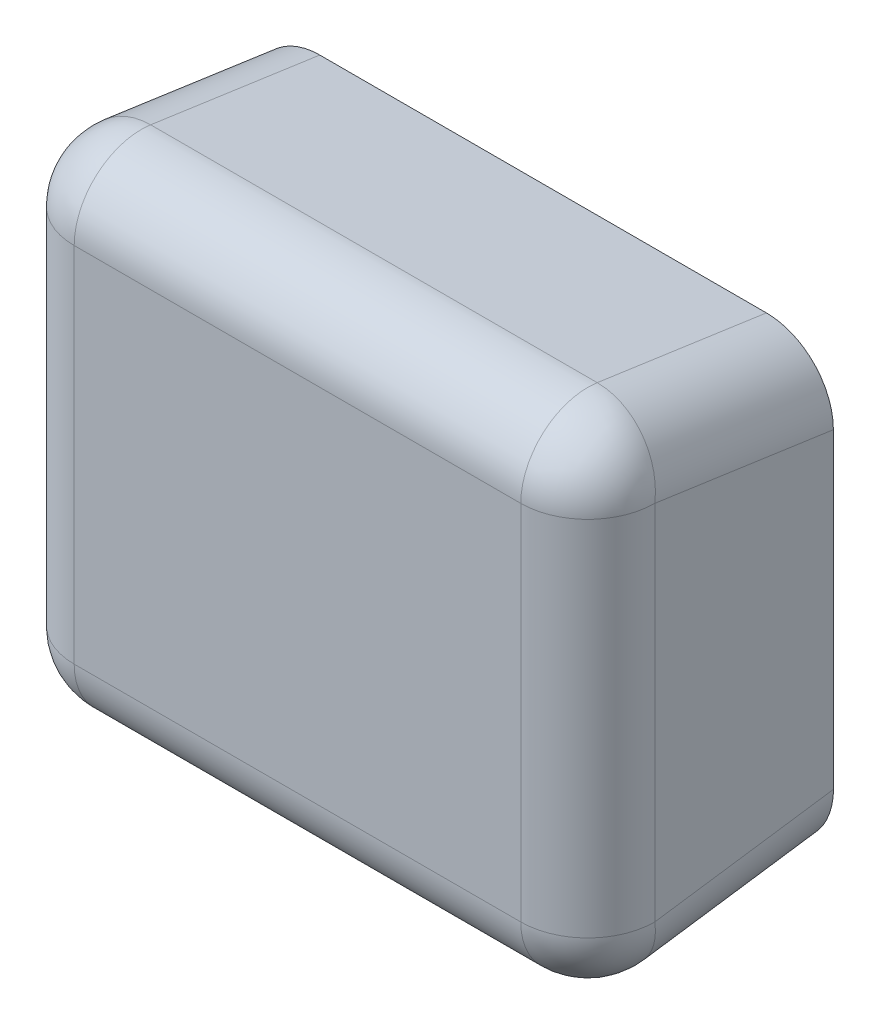
ISO-10303-21;
HEADER;
FILE_DESCRIPTION(('STEP AP214'),'2;1');
FILE_NAME('part.step','',(''),(''),'','','');
FILE_SCHEMA(('AUTOMOTIVE_DESIGN { 1 0 10303 214 1 1 1 1 }'));
ENDSEC;
DATA;
#1=APPLICATION_CONTEXT('core data for automotive mechanical design processes');
#2=APPLICATION_PROTOCOL_DEFINITION('international standard','automotive_design',2000,#1);
#3=PRODUCT_CONTEXT('',#1,'mechanical');
#4=PRODUCT('Part','Part','',(#3));
#5=PRODUCT_RELATED_PRODUCT_CATEGORY('part','',(#4));
#6=PRODUCT_DEFINITION_FORMATION('','',#4);
#7=PRODUCT_DEFINITION_CONTEXT('part definition',#1,'design');
#8=PRODUCT_DEFINITION('design','',#6,#7);
#9=PRODUCT_DEFINITION_SHAPE('','',#8);
#10=(LENGTH_UNIT() NAMED_UNIT(*) SI_UNIT(.MILLI.,.METRE.));
#11=(NAMED_UNIT(*) PLANE_ANGLE_UNIT() SI_UNIT($,.RADIAN.));
#12=(NAMED_UNIT(*) SI_UNIT($,.STERADIAN.) SOLID_ANGLE_UNIT());
#13=UNCERTAINTY_MEASURE_WITH_UNIT(LENGTH_MEASURE(1.E-05),#10,'distance_accuracy_value','');
#14=(GEOMETRIC_REPRESENTATION_CONTEXT(3) GLOBAL_UNCERTAINTY_ASSIGNED_CONTEXT((#13)) GLOBAL_UNIT_ASSIGNED_CONTEXT((#10,
#11,#12)) REPRESENTATION_CONTEXT('',''));
#15=CARTESIAN_POINT('',(0.,0.,0.));
#16=DIRECTION('',(0.,0.,1.));
#17=DIRECTION('',(1.,0.,0.));
#18=AXIS2_PLACEMENT_3D('',#15,#16,#17);
#19=CARTESIAN_POINT('',(0.,0.,0.));
#20=DIRECTION('',(0.,0.,1.));
#21=DIRECTION('',(1.,0.,0.));
#22=AXIS2_PLACEMENT_3D('',#19,#20,#21);
#23=PLANE('',#22);
#24=DIRECTION('',(-1.,0.,0.));
#25=VECTOR('',#24,1.);
#26=CARTESIAN_POINT('',(250.,200.101525445522,0.));
#27=LINE('',#26,#25);
#28=CARTESIAN_POINT('',(200.,200.101525445522,0.));
#29=VERTEX_POINT('',#28);
#30=CARTESIAN_POINT('',(-200.,200.101525445522,0.));
#31=VERTEX_POINT('',#30);
#32=EDGE_CURVE('E221',#29,#31,#27,.T.);
#33=ORIENTED_EDGE('',*,*,#32,.F.);
#34=CARTESIAN_POINT('',(200.,139.492372772389,0.));
#35=DIRECTION('',(0.,0.,1.));
#36=DIRECTION('',(0.,-1.,0.));
#37=AXIS2_PLACEMENT_3D('',#34,#35,#36);
#38=ELLIPSE('',#37,60.6091526731326,60.);
#39=CARTESIAN_POINT('',(260.,139.492372772389,0.));
#40=VERTEX_POINT('',#39);
#41=EDGE_CURVE('E127',#29,#40,#38,.F.);
#42=ORIENTED_EDGE('',*,*,#41,.T.);
#43=DIRECTION('',(0.,1.,0.));
#44=VECTOR('',#43,1.);
#45=CARTESIAN_POINT('',(260.,0.,0.));
#46=LINE('',#45,#44);
#47=CARTESIAN_POINT('',(260.,-139.49237277239,0.));
#48=VERTEX_POINT('',#47);
#49=EDGE_CURVE('E122',#48,#40,#46,.T.);
#50=ORIENTED_EDGE('',*,*,#49,.F.);
#51=CARTESIAN_POINT('',(200.,-139.492372772389,0.));
#52=DIRECTION('',(0.,0.,1.));
#53=DIRECTION('',(0.,-1.,0.));
#54=AXIS2_PLACEMENT_3D('',#51,#52,#53);
#55=ELLIPSE('',#54,60.6091526731327,60.);
#56=CARTESIAN_POINT('',(200.,-200.101525445522,0.));
#57=VERTEX_POINT('',#56);
#58=EDGE_CURVE('E124',#48,#57,#55,.F.);
#59=ORIENTED_EDGE('',*,*,#58,.T.);
#60=DIRECTION('',(1.,0.,0.));
#61=VECTOR('',#60,1.);
#62=CARTESIAN_POINT('',(250.,-200.101525445522,0.));
#63=LINE('',#62,#61);
#64=CARTESIAN_POINT('',(-200.,-200.101525445522,0.));
#65=VERTEX_POINT('',#64);
#66=EDGE_CURVE('E157',#65,#57,#63,.T.);
#67=ORIENTED_EDGE('',*,*,#66,.F.);
#68=CARTESIAN_POINT('',(-200.,-139.492372772389,0.));
#69=DIRECTION('',(0.,0.,1.));
#70=DIRECTION('',(0.,1.,0.));
#71=AXIS2_PLACEMENT_3D('',#68,#69,#70);
#72=ELLIPSE('',#71,60.6091526731327,60.);
#73=CARTESIAN_POINT('',(-260.,-139.492372772389,0.));
#74=VERTEX_POINT('',#73);
#75=EDGE_CURVE('E163',#65,#74,#72,.F.);
#76=ORIENTED_EDGE('',*,*,#75,.T.);
#77=DIRECTION('',(0.,1.,0.));
#78=VECTOR('',#77,1.);
#79=CARTESIAN_POINT('',(-260.,0.,0.));
#80=LINE('',#79,#78);
#81=CARTESIAN_POINT('',(-260.,139.492372772389,0.));
#82=VERTEX_POINT('',#81);
#83=EDGE_CURVE('E187',#74,#82,#80,.T.);
#84=ORIENTED_EDGE('',*,*,#83,.T.);
#85=CARTESIAN_POINT('',(-200.,139.492372772389,0.));
#86=DIRECTION('',(0.,0.,1.));
#87=DIRECTION('',(0.,1.,0.));
#88=AXIS2_PLACEMENT_3D('',#85,#86,#87);
#89=ELLIPSE('',#88,60.6091526731326,60.);
#90=EDGE_CURVE('E61',#82,#31,#89,.F.);
#91=ORIENTED_EDGE('',*,*,#90,.T.);
#92=EDGE_LOOP('',(#33,#42,#50,#59,#67,#76,#84,#91));
#93=FACE_BOUND('',#92,.T.);
#94=ADVANCED_FACE('F47',(#93),#23,.F.);
#95=CARTESIAN_POINT('',(200.,-136.702525316942,-19.5289321881345));
#96=DIRECTION('',(0.,-0.14142135623731,0.989949493661166));
#97=DIRECTION('',(0.,-0.989949493661167,-0.14142135623731));
#98=AXIS2_PLACEMENT_3D('',#95,#96,#97);
#99=CYLINDRICAL_SURFACE('',#98,60.);
#100=ORIENTED_EDGE('',*,*,#58,.F.);
#101=DIRECTION('',(0.,-0.14142135623731,0.989949493661166));
#102=VECTOR('',#101,1.);
#103=CARTESIAN_POINT('',(260.,-136.702525316942,-19.5289321881345));
#104=LINE('',#103,#102);
#105=CARTESIAN_POINT('',(260.,-162.349515629532,160.));
#106=VERTEX_POINT('',#105);
#107=EDGE_CURVE('E137',#106,#48,#104,.F.);
#108=ORIENTED_EDGE('',*,*,#107,.F.);
#109=CARTESIAN_POINT('',(200.,-162.349515629532,160.));
#110=DIRECTION('',(0.,-0.141421356237309,0.989949493661167));
#111=DIRECTION('',(0.,-0.989949493661167,-0.141421356237309));
#112=AXIS2_PLACEMENT_3D('',#109,#110,#111);
#113=CIRCLE('',#112,60.);
#114=CARTESIAN_POINT('',(200.,-221.746485249202,151.514718625761));
#115=VERTEX_POINT('',#114);
#116=EDGE_CURVE('E149',#115,#106,#113,.T.);
#117=ORIENTED_EDGE('',*,*,#116,.F.);
#118=DIRECTION('',(0.,-0.14142135623731,0.989949493661166));
#119=VECTOR('',#118,1.);
#120=CARTESIAN_POINT('',(200.,-229.899494936612,208.585786437627));
#121=LINE('',#120,#119);
#122=EDGE_CURVE('E140',#57,#115,#121,.T.);
#123=ORIENTED_EDGE('',*,*,#122,.F.);
#124=EDGE_LOOP('',(#100,#108,#117,#123));
#125=FACE_BOUND('',#124,.T.);
#126=ADVANCED_FACE('F136',(#125),#99,.T.);
#127=CARTESIAN_POINT('',(250.,-229.899494936612,208.585786437627));
#128=DIRECTION('',(0.,0.989949493661167,0.14142135623731));
#129=DIRECTION('',(0.,-0.14142135623731,0.989949493661166));
#130=AXIS2_PLACEMENT_3D('',#127,#128,#129);
#131=PLANE('',#130);
#132=DIRECTION('',(0.,-0.14142135623731,0.989949493661166));
#133=VECTOR('',#132,1.);
#134=CARTESIAN_POINT('',(-200.,-229.899494936612,208.585786437627));
#135=LINE('',#134,#133);
#136=CARTESIAN_POINT('',(-200.,-221.746485249202,151.514718625761));
#137=VERTEX_POINT('',#136);
#138=EDGE_CURVE('E154',#137,#65,#135,.F.);
#139=ORIENTED_EDGE('',*,*,#138,.T.);
#140=ORIENTED_EDGE('',*,*,#66,.T.);
#141=ORIENTED_EDGE('',*,*,#122,.T.);
#142=DIRECTION('',(1.,0.,0.));
#143=VECTOR('',#142,1.);
#144=CARTESIAN_POINT('',(250.,-221.746485249202,151.514718625761));
#145=LINE('',#144,#143);
#146=EDGE_CURVE('E160',#115,#137,#145,.F.);
#147=ORIENTED_EDGE('',*,*,#146,.T.);
#148=EDGE_LOOP('',(#139,#140,#141,#147));
#149=FACE_BOUND('',#148,.T.);
#150=ADVANCED_FACE('F297',(#149),#131,.F.);
#151=CARTESIAN_POINT('',(-200.,-170.502525316942,217.071067811865));
#152=DIRECTION('',(0.,0.14142135623731,-0.989949493661166));
#153=DIRECTION('',(0.,0.989949493661167,0.14142135623731));
#154=AXIS2_PLACEMENT_3D('',#151,#152,#153);
#155=CYLINDRICAL_SURFACE('',#154,60.);
#156=ORIENTED_EDGE('',*,*,#75,.F.);
#157=ORIENTED_EDGE('',*,*,#138,.F.);
#158=CARTESIAN_POINT('',(-200.,-162.349515629532,160.));
#159=DIRECTION('',(0.,0.14142135623731,-0.989949493661166));
#160=DIRECTION('',(0.,0.989949493661166,0.14142135623731));
#161=AXIS2_PLACEMENT_3D('',#158,#159,#160);
#162=CIRCLE('',#161,60.);
#163=CARTESIAN_POINT('',(-260.,-162.349515629532,160.));
#164=VERTEX_POINT('',#163);
#165=EDGE_CURVE('E166',#164,#137,#162,.F.);
#166=ORIENTED_EDGE('',*,*,#165,.F.);
#167=DIRECTION('',(0.,0.14142135623731,-0.989949493661166));
#168=VECTOR('',#167,1.);
#169=CARTESIAN_POINT('',(-260.,-170.502525316942,217.071067811865));
#170=LINE('',#169,#168);
#171=EDGE_CURVE('E133',#74,#164,#170,.F.);
#172=ORIENTED_EDGE('',*,*,#171,.F.);
#173=EDGE_LOOP('',(#156,#157,#166,#172));
#174=FACE_BOUND('',#173,.T.);
#175=ADVANCED_FACE('F294',(#174),#155,.T.);
#176=CARTESIAN_POINT('',(260.,0.,0.));
#177=DIRECTION('',(1.,0.,0.));
#178=DIRECTION('',(0.,0.,-1.));
#179=AXIS2_PLACEMENT_3D('',#176,#177,#178);
#180=PLANE('',#179);
#181=ORIENTED_EDGE('',*,*,#49,.T.);
#182=DIRECTION('',(0.,-0.141421356237309,-0.989949493661167));
#183=VECTOR('',#182,1.);
#184=CARTESIAN_POINT('',(260.,136.702525316942,-19.5289321881345));
#185=LINE('',#184,#183);
#186=CARTESIAN_POINT('',(260.,162.349515629532,160.));
#187=VERTEX_POINT('',#186);
#188=EDGE_CURVE('E132',#40,#187,#185,.F.);
#189=ORIENTED_EDGE('',*,*,#188,.T.);
#190=DIRECTION('',(0.,1.,0.));
#191=VECTOR('',#190,1.);
#192=CARTESIAN_POINT('',(260.,0.,160.));
#193=LINE('',#192,#191);
#194=EDGE_CURVE('E147',#187,#106,#193,.F.);
#195=ORIENTED_EDGE('',*,*,#194,.T.);
#196=ORIENTED_EDGE('',*,*,#107,.T.);
#197=EDGE_LOOP('',(#181,#189,#195,#196));
#198=FACE_BOUND('',#197,.T.);
#199=ADVANCED_FACE('F145',(#198),#180,.T.);
#200=CARTESIAN_POINT('',(200.,-162.349515629532,160.));
#201=DIRECTION('',(1.,0.,0.));
#202=DIRECTION('',(0.,0.,-1.));
#203=AXIS2_PLACEMENT_3D('',#200,#201,#202);
#204=SPHERICAL_SURFACE('',#203,60.);
#205=CARTESIAN_POINT('',(200.,-162.349515629532,160.));
#206=DIRECTION('',(1.,0.,0.));
#207=DIRECTION('',(0.,0.,-1.));
#208=AXIS2_PLACEMENT_3D('',#205,#206,#207);
#209=CIRCLE('',#208,60.);
#210=CARTESIAN_POINT('',(200.,-162.349515629532,220.));
#211=VERTEX_POINT('',#210);
#212=EDGE_CURVE('E173',#211,#115,#209,.T.);
#213=ORIENTED_EDGE('',*,*,#212,.T.);
#214=ORIENTED_EDGE('',*,*,#116,.T.);
#215=CARTESIAN_POINT('',(200.,-162.349515629532,160.));
#216=DIRECTION('',(0.,1.,0.));
#217=DIRECTION('',(0.,0.,1.));
#218=AXIS2_PLACEMENT_3D('',#215,#216,#217);
#219=CIRCLE('',#218,60.);
#220=EDGE_CURVE('E176',#211,#106,#219,.T.);
#221=ORIENTED_EDGE('',*,*,#220,.F.);
#222=EDGE_LOOP('',(#213,#214,#221));
#223=FACE_BOUND('',#222,.T.);
#224=ADVANCED_FACE('F287',(#223),#204,.T.);
#225=CARTESIAN_POINT('',(250.,-162.349515629532,160.));
#226=DIRECTION('',(-1.,0.,0.));
#227=DIRECTION('',(0.,0.,1.));
#228=AXIS2_PLACEMENT_3D('',#225,#226,#227);
#229=CYLINDRICAL_SURFACE('',#228,60.);
#230=CARTESIAN_POINT('',(-200.,-162.349515629532,160.));
#231=DIRECTION('',(-1.,0.,0.));
#232=DIRECTION('',(0.,0.,1.));
#233=AXIS2_PLACEMENT_3D('',#230,#231,#232);
#234=CIRCLE('',#233,60.);
#235=CARTESIAN_POINT('',(-200.,-162.349515629532,220.));
#236=VERTEX_POINT('',#235);
#237=EDGE_CURVE('E178',#236,#137,#234,.F.);
#238=ORIENTED_EDGE('',*,*,#237,.T.);
#239=ORIENTED_EDGE('',*,*,#146,.F.);
#240=ORIENTED_EDGE('',*,*,#212,.F.);
#241=DIRECTION('',(1.,0.,0.));
#242=VECTOR('',#241,1.);
#243=CARTESIAN_POINT('',(250.,-162.349515629532,220.));
#244=LINE('',#243,#242);
#245=EDGE_CURVE('E181',#236,#211,#244,.T.);
#246=ORIENTED_EDGE('',*,*,#245,.F.);
#247=EDGE_LOOP('',(#238,#239,#240,#246));
#248=FACE_BOUND('',#247,.T.);
#249=ADVANCED_FACE('F283',(#248),#229,.T.);
#250=CARTESIAN_POINT('',(-200.,-162.349515629532,160.));
#251=DIRECTION('',(-1.,0.,0.));
#252=DIRECTION('',(0.,0.,1.));
#253=AXIS2_PLACEMENT_3D('',#250,#251,#252);
#254=SPHERICAL_SURFACE('',#253,60.);
#255=CARTESIAN_POINT('',(-200.,-162.349515629532,160.));
#256=DIRECTION('',(0.,-1.,0.));
#257=DIRECTION('',(0.,0.,-1.));
#258=AXIS2_PLACEMENT_3D('',#255,#256,#257);
#259=CIRCLE('',#258,60.);
#260=EDGE_CURVE('E184',#236,#164,#259,.T.);
#261=ORIENTED_EDGE('',*,*,#260,.T.);
#262=ORIENTED_EDGE('',*,*,#165,.T.);
#263=ORIENTED_EDGE('',*,*,#237,.F.);
#264=EDGE_LOOP('',(#261,#262,#263));
#265=FACE_BOUND('',#264,.T.);
#266=ADVANCED_FACE('F279',(#265),#254,.T.);
#267=CARTESIAN_POINT('',(-260.,0.,0.));
#268=DIRECTION('',(1.,0.,0.));
#269=DIRECTION('',(0.,0.,-1.));
#270=AXIS2_PLACEMENT_3D('',#267,#268,#269);
#271=PLANE('',#270);
#272=ORIENTED_EDGE('',*,*,#83,.F.);
#273=ORIENTED_EDGE('',*,*,#171,.T.);
#274=DIRECTION('',(0.,1.,0.));
#275=VECTOR('',#274,1.);
#276=CARTESIAN_POINT('',(-260.,0.,160.));
#277=LINE('',#276,#275);
#278=CARTESIAN_POINT('',(-260.,162.349515629532,160.));
#279=VERTEX_POINT('',#278);
#280=EDGE_CURVE('E190',#164,#279,#277,.T.);
#281=ORIENTED_EDGE('',*,*,#280,.T.);
#282=DIRECTION('',(0.,0.141421356237309,0.989949493661167));
#283=VECTOR('',#282,1.);
#284=CARTESIAN_POINT('',(-260.,140.502525316942,7.07106781186552));
#285=LINE('',#284,#283);
#286=EDGE_CURVE('E192',#279,#82,#285,.F.);
#287=ORIENTED_EDGE('',*,*,#286,.T.);
#288=EDGE_LOOP('',(#272,#273,#281,#287));
#289=FACE_BOUND('',#288,.T.);
#290=ADVANCED_FACE('F275',(#289),#271,.F.);
#291=CARTESIAN_POINT('',(200.,136.702525316942,-19.5289321881345));
#292=DIRECTION('',(0.,-0.141421356237309,-0.989949493661167));
#293=DIRECTION('',(0.,0.989949493661167,-0.141421356237309));
#294=AXIS2_PLACEMENT_3D('',#291,#292,#293);
#295=CYLINDRICAL_SURFACE('',#294,60.);
#296=ORIENTED_EDGE('',*,*,#41,.F.);
#297=DIRECTION('',(0.,-0.141421356237309,-0.989949493661167));
#298=VECTOR('',#297,1.);
#299=CARTESIAN_POINT('',(200.,199.899494936612,-1.41421356237305));
#300=LINE('',#299,#298);
#301=CARTESIAN_POINT('',(200.,221.746485249202,151.514718625761));
#302=VERTEX_POINT('',#301);
#303=EDGE_CURVE('E197',#302,#29,#300,.T.);
#304=ORIENTED_EDGE('',*,*,#303,.F.);
#305=CARTESIAN_POINT('',(200.,162.349515629532,160.));
#306=DIRECTION('',(0.,-0.14142135623731,-0.989949493661166));
#307=DIRECTION('',(0.,0.989949493661167,-0.14142135623731));
#308=AXIS2_PLACEMENT_3D('',#305,#306,#307);
#309=CIRCLE('',#308,60.);
#310=EDGE_CURVE('E200',#187,#302,#309,.F.);
#311=ORIENTED_EDGE('',*,*,#310,.F.);
#312=ORIENTED_EDGE('',*,*,#188,.F.);
#313=EDGE_LOOP('',(#296,#304,#311,#312));
#314=FACE_BOUND('',#313,.T.);
#315=ADVANCED_FACE('F271',(#314),#295,.T.);
#316=CARTESIAN_POINT('',(200.,0.,160.));
#317=DIRECTION('',(0.,1.,0.));
#318=DIRECTION('',(0.,0.,1.));
#319=AXIS2_PLACEMENT_3D('',#316,#317,#318);
#320=CYLINDRICAL_SURFACE('',#319,60.);
#321=CARTESIAN_POINT('',(200.,162.349515629532,160.));
#322=DIRECTION('',(0.,1.,0.));
#323=DIRECTION('',(0.,0.,1.));
#324=AXIS2_PLACEMENT_3D('',#321,#322,#323);
#325=CIRCLE('',#324,60.);
#326=CARTESIAN_POINT('',(200.,162.349515629532,220.));
#327=VERTEX_POINT('',#326);
#328=EDGE_CURVE('E203',#187,#327,#325,.F.);
#329=ORIENTED_EDGE('',*,*,#328,.T.);
#330=DIRECTION('',(0.,1.,0.));
#331=VECTOR('',#330,1.);
#332=CARTESIAN_POINT('',(200.,220.,220.));
#333=LINE('',#332,#331);
#334=EDGE_CURVE('E205',#211,#327,#333,.T.);
#335=ORIENTED_EDGE('',*,*,#334,.F.);
#336=ORIENTED_EDGE('',*,*,#220,.T.);
#337=ORIENTED_EDGE('',*,*,#194,.F.);
#338=EDGE_LOOP('',(#329,#335,#336,#337));
#339=FACE_BOUND('',#338,.T.);
#340=ADVANCED_FACE('F268',(#339),#320,.T.);
#341=CARTESIAN_POINT('',(250.,220.,220.));
#342=DIRECTION('',(0.,0.,-1.));
#343=DIRECTION('',(0.,1.,0.));
#344=AXIS2_PLACEMENT_3D('',#341,#342,#343);
#345=PLANE('',#344);
#346=ORIENTED_EDGE('',*,*,#245,.T.);
#347=ORIENTED_EDGE('',*,*,#334,.T.);
#348=DIRECTION('',(1.,0.,0.));
#349=VECTOR('',#348,1.);
#350=CARTESIAN_POINT('',(250.,162.349515629532,220.));
#351=LINE('',#350,#349);
#352=CARTESIAN_POINT('',(-200.,162.349515629532,220.));
#353=VERTEX_POINT('',#352);
#354=EDGE_CURVE('E208',#327,#353,#351,.F.);
#355=ORIENTED_EDGE('',*,*,#354,.T.);
#356=DIRECTION('',(0.,1.,0.));
#357=VECTOR('',#356,1.);
#358=CARTESIAN_POINT('',(-200.,220.,220.));
#359=LINE('',#358,#357);
#360=EDGE_CURVE('E210',#353,#236,#359,.F.);
#361=ORIENTED_EDGE('',*,*,#360,.T.);
#362=EDGE_LOOP('',(#346,#347,#355,#361));
#363=FACE_BOUND('',#362,.T.);
#364=ADVANCED_FACE('F240',(#363),#345,.F.);
#365=CARTESIAN_POINT('',(-200.,220.,160.));
#366=DIRECTION('',(0.,-1.,0.));
#367=DIRECTION('',(0.,0.,-1.));
#368=AXIS2_PLACEMENT_3D('',#365,#366,#367);
#369=CYLINDRICAL_SURFACE('',#368,60.);
#370=CARTESIAN_POINT('',(-200.,162.349515629532,160.));
#371=DIRECTION('',(0.,-1.,0.));
#372=DIRECTION('',(0.,0.,-1.));
#373=AXIS2_PLACEMENT_3D('',#370,#371,#372);
#374=CIRCLE('',#373,60.);
#375=EDGE_CURVE('E213',#279,#353,#374,.F.);
#376=ORIENTED_EDGE('',*,*,#375,.F.);
#377=ORIENTED_EDGE('',*,*,#280,.F.);
#378=ORIENTED_EDGE('',*,*,#260,.F.);
#379=ORIENTED_EDGE('',*,*,#360,.F.);
#380=EDGE_LOOP('',(#376,#377,#378,#379));
#381=FACE_BOUND('',#380,.T.);
#382=ADVANCED_FACE('F245',(#381),#369,.T.);
#383=CARTESIAN_POINT('',(-200.,140.502525316942,7.07106781186552));
#384=DIRECTION('',(0.,0.141421356237309,0.989949493661167));
#385=DIRECTION('',(0.,-0.989949493661167,0.141421356237309));
#386=AXIS2_PLACEMENT_3D('',#383,#384,#385);
#387=CYLINDRICAL_SURFACE('',#386,60.);
#388=ORIENTED_EDGE('',*,*,#90,.F.);
#389=ORIENTED_EDGE('',*,*,#286,.F.);
#390=CARTESIAN_POINT('',(-200.,162.349515629532,160.));
#391=DIRECTION('',(0.,0.14142135623731,0.989949493661167));
#392=DIRECTION('',(0.,-0.989949493661167,0.14142135623731));
#393=AXIS2_PLACEMENT_3D('',#390,#391,#392);
#394=CIRCLE('',#393,60.);
#395=CARTESIAN_POINT('',(-200.,221.746485249202,151.514718625761));
#396=VERTEX_POINT('',#395);
#397=EDGE_CURVE('E68',#396,#279,#394,.T.);
#398=ORIENTED_EDGE('',*,*,#397,.F.);
#399=DIRECTION('',(0.,-0.141421356237309,-0.989949493661167));
#400=VECTOR('',#399,1.);
#401=CARTESIAN_POINT('',(-200.,199.899494936612,-1.41421356237305));
#402=LINE('',#401,#400);
#403=EDGE_CURVE('E219',#31,#396,#402,.F.);
#404=ORIENTED_EDGE('',*,*,#403,.F.);
#405=EDGE_LOOP('',(#388,#389,#398,#404));
#406=FACE_BOUND('',#405,.T.);
#407=ADVANCED_FACE('F260',(#406),#387,.T.);
#408=CARTESIAN_POINT('',(250.,199.899494936612,-1.41421356237305));
#409=DIRECTION('',(0.,-0.989949493661167,0.141421356237309));
#410=DIRECTION('',(0.,-0.141421356237309,-0.989949493661167));
#411=AXIS2_PLACEMENT_3D('',#408,#409,#410);
#412=PLANE('',#411);
#413=ORIENTED_EDGE('',*,*,#303,.T.);
#414=ORIENTED_EDGE('',*,*,#32,.T.);
#415=ORIENTED_EDGE('',*,*,#403,.T.);
#416=DIRECTION('',(1.,0.,0.));
#417=VECTOR('',#416,1.);
#418=CARTESIAN_POINT('',(250.,221.746485249202,151.514718625761));
#419=LINE('',#418,#417);
#420=EDGE_CURVE('E225',#396,#302,#419,.T.);
#421=ORIENTED_EDGE('',*,*,#420,.T.);
#422=EDGE_LOOP('',(#413,#414,#415,#421));
#423=FACE_BOUND('',#422,.T.);
#424=ADVANCED_FACE('F257',(#423),#412,.F.);
#425=CARTESIAN_POINT('',(200.,162.349515629532,160.));
#426=DIRECTION('',(1.,0.,0.));
#427=DIRECTION('',(0.,0.,-1.));
#428=AXIS2_PLACEMENT_3D('',#425,#426,#427);
#429=SPHERICAL_SURFACE('',#428,60.);
#430=ORIENTED_EDGE('',*,*,#310,.T.);
#431=CARTESIAN_POINT('',(200.,162.349515629532,160.));
#432=DIRECTION('',(1.,0.,0.));
#433=DIRECTION('',(0.,0.,-1.));
#434=AXIS2_PLACEMENT_3D('',#431,#432,#433);
#435=CIRCLE('',#434,60.);
#436=EDGE_CURVE('E54',#302,#327,#435,.T.);
#437=ORIENTED_EDGE('',*,*,#436,.T.);
#438=ORIENTED_EDGE('',*,*,#328,.F.);
#439=EDGE_LOOP('',(#430,#437,#438));
#440=FACE_BOUND('',#439,.T.);
#441=ADVANCED_FACE('F231',(#440),#429,.T.);
#442=CARTESIAN_POINT('',(250.,162.349515629532,160.));
#443=DIRECTION('',(-1.,0.,0.));
#444=DIRECTION('',(0.,0.,1.));
#445=AXIS2_PLACEMENT_3D('',#442,#443,#444);
#446=CYLINDRICAL_SURFACE('',#445,60.);
#447=CARTESIAN_POINT('',(-200.,162.349515629532,160.));
#448=DIRECTION('',(-1.,0.,0.));
#449=DIRECTION('',(0.,0.,1.));
#450=AXIS2_PLACEMENT_3D('',#447,#448,#449);
#451=CIRCLE('',#450,60.);
#452=EDGE_CURVE('E11',#396,#353,#451,.F.);
#453=ORIENTED_EDGE('',*,*,#452,.T.);
#454=ORIENTED_EDGE('',*,*,#354,.F.);
#455=ORIENTED_EDGE('',*,*,#436,.F.);
#456=ORIENTED_EDGE('',*,*,#420,.F.);
#457=EDGE_LOOP('',(#453,#454,#455,#456));
#458=FACE_BOUND('',#457,.T.);
#459=ADVANCED_FACE('F236',(#458),#446,.T.);
#460=CARTESIAN_POINT('',(-200.,162.349515629532,160.));
#461=DIRECTION('',(-1.,0.,0.));
#462=DIRECTION('',(0.,0.,1.));
#463=AXIS2_PLACEMENT_3D('',#460,#461,#462);
#464=SPHERICAL_SURFACE('',#463,60.);
#465=ORIENTED_EDGE('',*,*,#397,.T.);
#466=ORIENTED_EDGE('',*,*,#375,.T.);
#467=ORIENTED_EDGE('',*,*,#452,.F.);
#468=EDGE_LOOP('',(#465,#466,#467));
#469=FACE_BOUND('',#468,.T.);
#470=ADVANCED_FACE('F248',(#469),#464,.T.);
#471=CLOSED_SHELL('',(#94,#126,#150,#175,#199,#224,#249,#266,#290,#315,#340,#364,#382,#407,#424,
#441,#459,#470));
#472=MANIFOLD_SOLID_BREP('B2',#471);
#473=ADVANCED_BREP_SHAPE_REPRESENTATION('',(#18,#472),#14);
#474=SHAPE_DEFINITION_REPRESENTATION(#9,#473);
ENDSEC;
END-ISO-10303-21;
